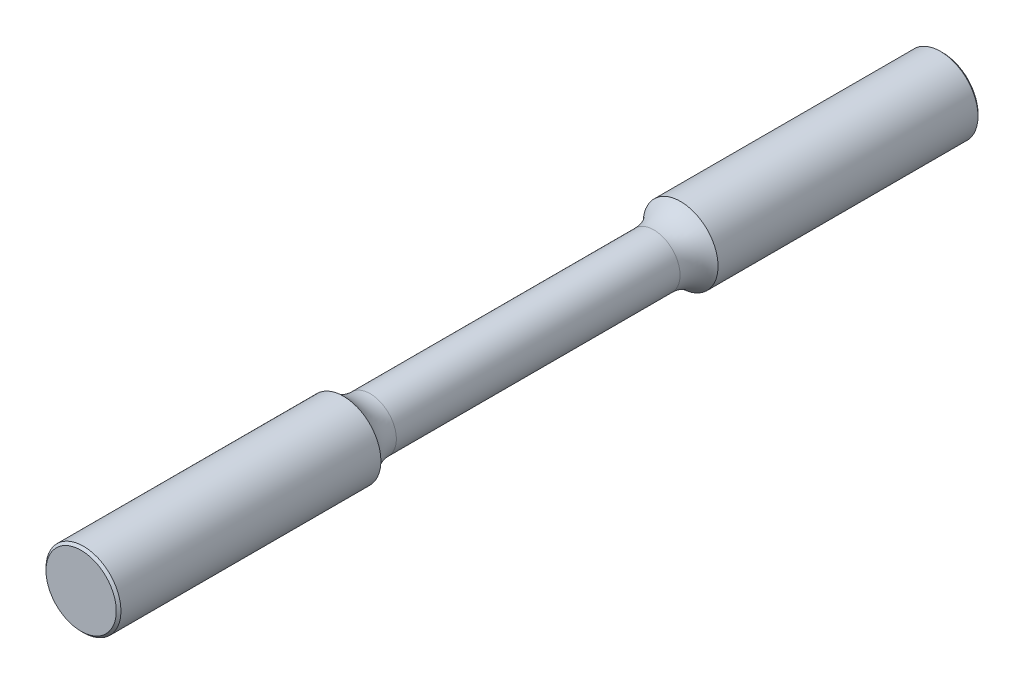
ISO-10303-21;
HEADER;
FILE_DESCRIPTION(('STEP AP214'),'2;1');
FILE_NAME('part.step','',(''),(''),'','','');
FILE_SCHEMA(('AUTOMOTIVE_DESIGN { 1 0 10303 214 1 1 1 1 }'));
ENDSEC;
DATA;
#1=APPLICATION_CONTEXT('core data for automotive mechanical design processes');
#2=APPLICATION_PROTOCOL_DEFINITION('international standard','automotive_design',2000,#1);
#3=PRODUCT_CONTEXT('',#1,'mechanical');
#4=PRODUCT('Part','Part','',(#3));
#5=PRODUCT_RELATED_PRODUCT_CATEGORY('part','',(#4));
#6=PRODUCT_DEFINITION_FORMATION('','',#4);
#7=PRODUCT_DEFINITION_CONTEXT('part definition',#1,'design');
#8=PRODUCT_DEFINITION('design','',#6,#7);
#9=PRODUCT_DEFINITION_SHAPE('','',#8);
#10=(LENGTH_UNIT() NAMED_UNIT(*) SI_UNIT(.MILLI.,.METRE.));
#11=(NAMED_UNIT(*) PLANE_ANGLE_UNIT() SI_UNIT($,.RADIAN.));
#12=(NAMED_UNIT(*) SI_UNIT($,.STERADIAN.) SOLID_ANGLE_UNIT());
#13=UNCERTAINTY_MEASURE_WITH_UNIT(LENGTH_MEASURE(1.E-05),#10,'distance_accuracy_value','');
#14=(GEOMETRIC_REPRESENTATION_CONTEXT(3) GLOBAL_UNCERTAINTY_ASSIGNED_CONTEXT((#13)) GLOBAL_UNIT_ASSIGNED_CONTEXT((#10,
#11,#12)) REPRESENTATION_CONTEXT('',''));
#15=CARTESIAN_POINT('',(0.,0.,0.));
#16=DIRECTION('',(0.,0.,1.));
#17=DIRECTION('',(1.,0.,0.));
#18=AXIS2_PLACEMENT_3D('',#15,#16,#17);
#19=CARTESIAN_POINT('',(0.,0.,24.0401929478753));
#20=DIRECTION('',(0.,0.,-1.));
#21=DIRECTION('',(-1.,0.,0.));
#22=AXIS2_PLACEMENT_3D('',#19,#20,#21);
#23=TOROIDAL_SURFACE('',#22,10.795,6.34999999999999);
#24=CARTESIAN_POINT('',(0.,0.,24.0401929478753));
#25=DIRECTION('',(0.,0.,-1.));
#26=DIRECTION('',(-1.,0.,0.));
#27=AXIS2_PLACEMENT_3D('',#24,#25,#26);
#28=CIRCLE('',#27,4.445);
#29=CARTESIAN_POINT('',(-4.44499999999999,0.,24.0401929478753));
#30=VERTEX_POINT('',#29);
#31=EDGE_CURVE('E63',#30,#30,#28,.T.);
#32=ORIENTED_EDGE('',*,*,#31,.F.);
#33=EDGE_LOOP('',(#32));
#34=FACE_BOUND('',#33,.T.);
#35=CARTESIAN_POINT('',(0.,0.,28.575));
#36=DIRECTION('',(0.,0.,-1.));
#37=DIRECTION('',(-1.,0.,0.));
#38=AXIS2_PLACEMENT_3D('',#35,#36,#37);
#39=CIRCLE('',#38,6.35000000000001);
#40=CARTESIAN_POINT('',(-6.35,0.,28.575));
#41=VERTEX_POINT('',#40);
#42=EDGE_CURVE('E75',#41,#41,#39,.T.);
#43=ORIENTED_EDGE('',*,*,#42,.T.);
#44=EDGE_LOOP('',(#43));
#45=FACE_BOUND('',#44,.T.);
#46=ADVANCED_FACE('F38',(#34,#45),#23,.F.);
#47=CARTESIAN_POINT('',(0.,0.,-73.025));
#48=DIRECTION('',(0.,0.,-1.));
#49=DIRECTION('',(-1.,0.,0.));
#50=AXIS2_PLACEMENT_3D('',#47,#48,#49);
#51=CYLINDRICAL_SURFACE('',#50,4.44500000000001);
#52=CARTESIAN_POINT('',(0.,0.,-24.0401929478753));
#53=DIRECTION('',(0.,0.,-1.));
#54=DIRECTION('',(-1.,0.,0.));
#55=AXIS2_PLACEMENT_3D('',#52,#53,#54);
#56=CIRCLE('',#55,4.44500000000002);
#57=CARTESIAN_POINT('',(-4.44500000000002,0.,-24.0401929478753));
#58=VERTEX_POINT('',#57);
#59=EDGE_CURVE('E67',#58,#58,#56,.T.);
#60=ORIENTED_EDGE('',*,*,#59,.F.);
#61=EDGE_LOOP('',(#60));
#62=FACE_BOUND('',#61,.T.);
#63=ORIENTED_EDGE('',*,*,#31,.T.);
#64=EDGE_LOOP('',(#63));
#65=FACE_BOUND('',#64,.T.);
#66=ADVANCED_FACE('F95',(#62,#65),#51,.T.);
#67=CARTESIAN_POINT('',(0.,0.,-24.0401929478753));
#68=DIRECTION('',(0.,0.,-1.));
#69=DIRECTION('',(-1.,0.,0.));
#70=AXIS2_PLACEMENT_3D('',#67,#68,#69);
#71=TOROIDAL_SURFACE('',#70,10.795,6.35);
#72=CARTESIAN_POINT('',(0.,0.,-28.575));
#73=DIRECTION('',(0.,0.,-1.));
#74=DIRECTION('',(-1.,0.,0.));
#75=AXIS2_PLACEMENT_3D('',#72,#73,#74);
#76=CIRCLE('',#75,6.35000000000001);
#77=CARTESIAN_POINT('',(-6.35000000000002,0.,-28.575));
#78=VERTEX_POINT('',#77);
#79=EDGE_CURVE('E71',#78,#78,#76,.T.);
#80=ORIENTED_EDGE('',*,*,#79,.F.);
#81=EDGE_LOOP('',(#80));
#82=FACE_BOUND('',#81,.T.);
#83=ORIENTED_EDGE('',*,*,#59,.T.);
#84=EDGE_LOOP('',(#83));
#85=FACE_BOUND('',#84,.T.);
#86=ADVANCED_FACE('F101',(#82,#85),#71,.F.);
#87=CARTESIAN_POINT('',(0.,0.,-73.025));
#88=DIRECTION('',(0.,0.,-1.));
#89=DIRECTION('',(-1.,0.,0.));
#90=AXIS2_PLACEMENT_3D('',#87,#88,#89);
#91=CYLINDRICAL_SURFACE('',#90,6.35000000000002);
#92=CARTESIAN_POINT('',(0.,0.,-72.628125));
#93=DIRECTION('',(0.,0.,1.));
#94=DIRECTION('',(1.,0.,0.));
#95=AXIS2_PLACEMENT_3D('',#92,#93,#94);
#96=CIRCLE('',#95,6.35000000000002);
#97=CARTESIAN_POINT('',(6.35,0.,-72.628125));
#98=VERTEX_POINT('',#97);
#99=EDGE_CURVE('E52',#98,#98,#96,.T.);
#100=ORIENTED_EDGE('',*,*,#99,.T.);
#101=EDGE_LOOP('',(#100));
#102=FACE_BOUND('',#101,.T.);
#103=ORIENTED_EDGE('',*,*,#79,.T.);
#104=EDGE_LOOP('',(#103));
#105=FACE_BOUND('',#104,.T.);
#106=ADVANCED_FACE('F113',(#102,#105),#91,.T.);
#107=CARTESIAN_POINT('',(0.,0.,-73.025));
#108=DIRECTION('',(0.,0.,1.));
#109=DIRECTION('',(1.,0.,0.));
#110=AXIS2_PLACEMENT_3D('',#107,#108,#109);
#111=PLANE('',#110);
#112=CARTESIAN_POINT('',(0.,0.,-73.025));
#113=DIRECTION('',(0.,0.,1.));
#114=DIRECTION('',(1.,0.,0.));
#115=AXIS2_PLACEMENT_3D('',#112,#113,#114);
#116=CIRCLE('',#115,5.95312500000006);
#117=CARTESIAN_POINT('',(5.95312500000004,0.,-73.025));
#118=VERTEX_POINT('',#117);
#119=EDGE_CURVE('E57',#118,#118,#116,.F.);
#120=ORIENTED_EDGE('',*,*,#119,.T.);
#121=EDGE_LOOP('',(#120));
#122=FACE_BOUND('',#121,.T.);
#123=ADVANCED_FACE('F92',(#122),#111,.F.);
#124=CARTESIAN_POINT('',(0.,0.,73.025));
#125=DIRECTION('',(0.,0.,-1.));
#126=DIRECTION('',(-1.,0.,0.));
#127=AXIS2_PLACEMENT_3D('',#124,#125,#126);
#128=PLANE('',#127);
#129=CARTESIAN_POINT('',(0.,0.,73.025));
#130=DIRECTION('',(0.,0.,-1.));
#131=DIRECTION('',(-1.,0.,0.));
#132=AXIS2_PLACEMENT_3D('',#129,#130,#131);
#133=CIRCLE('',#132,5.95312500000001);
#134=CARTESIAN_POINT('',(-5.95312499999999,0.,73.025));
#135=VERTEX_POINT('',#134);
#136=EDGE_CURVE('E10',#135,#135,#133,.F.);
#137=ORIENTED_EDGE('',*,*,#136,.T.);
#138=EDGE_LOOP('',(#137));
#139=FACE_BOUND('',#138,.T.);
#140=ADVANCED_FACE('F84',(#139),#128,.F.);
#141=CARTESIAN_POINT('',(0.,0.,-73.025));
#142=DIRECTION('',(0.,0.,-1.));
#143=DIRECTION('',(-1.,0.,0.));
#144=AXIS2_PLACEMENT_3D('',#141,#142,#143);
#145=CYLINDRICAL_SURFACE('',#144,6.35000000000001);
#146=CARTESIAN_POINT('',(0.,0.,72.628125));
#147=DIRECTION('',(0.,0.,-1.));
#148=DIRECTION('',(-1.,0.,0.));
#149=AXIS2_PLACEMENT_3D('',#146,#147,#148);
#150=CIRCLE('',#149,6.35000000000001);
#151=CARTESIAN_POINT('',(-6.34999999999998,0.,72.628125));
#152=VERTEX_POINT('',#151);
#153=EDGE_CURVE('E47',#152,#152,#150,.T.);
#154=ORIENTED_EDGE('',*,*,#153,.T.);
#155=EDGE_LOOP('',(#154));
#156=FACE_BOUND('',#155,.T.);
#157=ORIENTED_EDGE('',*,*,#42,.F.);
#158=EDGE_LOOP('',(#157));
#159=FACE_BOUND('',#158,.T.);
#160=ADVANCED_FACE('F81',(#156,#159),#145,.T.);
#161=CARTESIAN_POINT('',(0.,0.,-73.025));
#162=DIRECTION('',(0.,0.,1.));
#163=DIRECTION('',(1.,0.,0.));
#164=AXIS2_PLACEMENT_3D('',#161,#162,#163);
#165=CONICAL_SURFACE('',#164,5.95312500000006,0.785398163397448);
#166=ORIENTED_EDGE('',*,*,#99,.F.);
#167=EDGE_LOOP('',(#166));
#168=FACE_BOUND('',#167,.T.);
#169=ORIENTED_EDGE('',*,*,#119,.F.);
#170=EDGE_LOOP('',(#169));
#171=FACE_BOUND('',#170,.T.);
#172=ADVANCED_FACE('F83',(#168,#171),#165,.T.);
#173=CARTESIAN_POINT('',(0.,0.,72.628125));
#174=DIRECTION('',(0.,0.,-1.));
#175=DIRECTION('',(-1.,0.,0.));
#176=AXIS2_PLACEMENT_3D('',#173,#174,#175);
#177=CONICAL_SURFACE('',#176,6.35000000000001,0.78539816339745);
#178=ORIENTED_EDGE('',*,*,#136,.F.);
#179=EDGE_LOOP('',(#178));
#180=FACE_BOUND('',#179,.T.);
#181=ORIENTED_EDGE('',*,*,#153,.F.);
#182=EDGE_LOOP('',(#181));
#183=FACE_BOUND('',#182,.T.);
#184=ADVANCED_FACE('F41',(#180,#183),#177,.T.);
#185=CLOSED_SHELL('',(#46,#66,#86,#106,#123,#140,#160,#172,#184));
#186=MANIFOLD_SOLID_BREP('B2',#185);
#187=ADVANCED_BREP_SHAPE_REPRESENTATION('',(#18,#186),#14);
#188=SHAPE_DEFINITION_REPRESENTATION(#9,#187);
ENDSEC;
END-ISO-10303-21;
